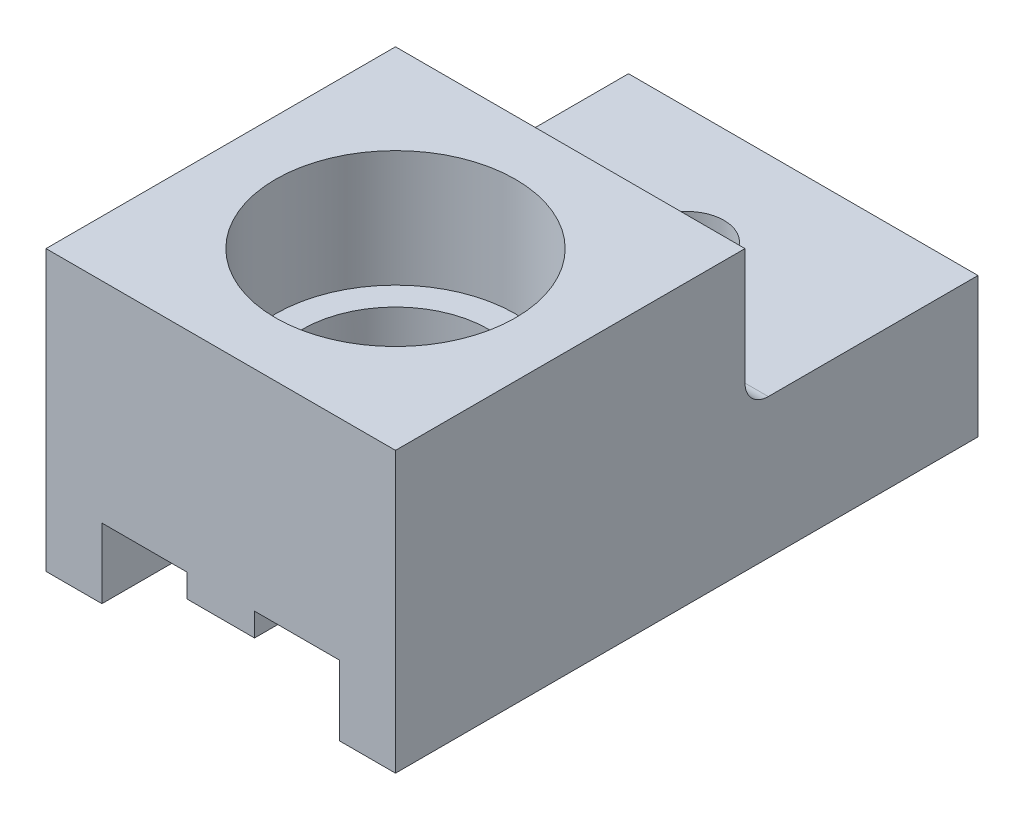
ISO-10303-21;
HEADER;
FILE_DESCRIPTION(('STEP AP214'),'2;1');
FILE_NAME('part.step','',(''),(''),'','','');
FILE_SCHEMA(('AUTOMOTIVE_DESIGN { 1 0 10303 214 1 1 1 1 }'));
ENDSEC;
DATA;
#1=APPLICATION_CONTEXT('core data for automotive mechanical design processes');
#2=APPLICATION_PROTOCOL_DEFINITION('international standard','automotive_design',2000,#1);
#3=PRODUCT_CONTEXT('',#1,'mechanical');
#4=PRODUCT('Part','Part','',(#3));
#5=PRODUCT_RELATED_PRODUCT_CATEGORY('part','',(#4));
#6=PRODUCT_DEFINITION_FORMATION('','',#4);
#7=PRODUCT_DEFINITION_CONTEXT('part definition',#1,'design');
#8=PRODUCT_DEFINITION('design','',#6,#7);
#9=PRODUCT_DEFINITION_SHAPE('','',#8);
#10=(LENGTH_UNIT() NAMED_UNIT(*) SI_UNIT(.MILLI.,.METRE.));
#11=(NAMED_UNIT(*) PLANE_ANGLE_UNIT() SI_UNIT($,.RADIAN.));
#12=(NAMED_UNIT(*) SI_UNIT($,.STERADIAN.) SOLID_ANGLE_UNIT());
#13=UNCERTAINTY_MEASURE_WITH_UNIT(LENGTH_MEASURE(1.E-05),#10,'distance_accuracy_value','');
#14=(GEOMETRIC_REPRESENTATION_CONTEXT(3) GLOBAL_UNCERTAINTY_ASSIGNED_CONTEXT((#13)) GLOBAL_UNIT_ASSIGNED_CONTEXT((#10,
#11,#12)) REPRESENTATION_CONTEXT('',''));
#15=CARTESIAN_POINT('',(0.,0.,0.));
#16=DIRECTION('',(0.,0.,1.));
#17=DIRECTION('',(1.,0.,0.));
#18=AXIS2_PLACEMENT_3D('',#15,#16,#17);
#19=CARTESIAN_POINT('',(-1.45,0.,25.));
#20=DIRECTION('',(1.,0.,0.));
#21=DIRECTION('',(0.,0.,-1.));
#22=AXIS2_PLACEMENT_3D('',#19,#20,#21);
#23=PLANE('',#22);
#24=DIRECTION('',(0.,0.,-1.));
#25=VECTOR('',#24,1.);
#26=CARTESIAN_POINT('',(-1.45,-1.,25.));
#27=LINE('',#26,#25);
#28=CARTESIAN_POINT('',(-1.45,-1.,4.32361253707657));
#29=VERTEX_POINT('',#28);
#30=CARTESIAN_POINT('',(-1.45,-1.,0.));
#31=VERTEX_POINT('',#30);
#32=EDGE_CURVE('E236',#29,#31,#27,.T.);
#33=ORIENTED_EDGE('',*,*,#32,.F.);
#34=DIRECTION('',(0.,1.,0.));
#35=VECTOR('',#34,1.);
#36=CARTESIAN_POINT('',(-1.45,-3.,4.32361253707657));
#37=LINE('',#36,#35);
#38=CARTESIAN_POINT('',(-1.45,0.,4.32361253707657));
#39=VERTEX_POINT('',#38);
#40=EDGE_CURVE('E276',#29,#39,#37,.T.);
#41=ORIENTED_EDGE('',*,*,#40,.T.);
#42=DIRECTION('',(0.,0.,-1.));
#43=VECTOR('',#42,1.);
#44=CARTESIAN_POINT('',(-1.45,0.,25.));
#45=LINE('',#44,#43);
#46=CARTESIAN_POINT('',(-1.45,0.,0.));
#47=VERTEX_POINT('',#46);
#48=EDGE_CURVE('E241',#39,#47,#45,.T.);
#49=ORIENTED_EDGE('',*,*,#48,.T.);
#50=DIRECTION('',(0.,-1.,0.));
#51=VECTOR('',#50,1.);
#52=CARTESIAN_POINT('',(-1.45,0.,0.));
#53=LINE('',#52,#51);
#54=EDGE_CURVE('E342',#47,#31,#53,.T.);
#55=ORIENTED_EDGE('',*,*,#54,.T.);
#56=EDGE_LOOP('',(#33,#41,#49,#55));
#57=FACE_BOUND('',#56,.T.);
#58=ADVANCED_FACE('F33',(#57),#23,.F.);
#59=CARTESIAN_POINT('',(-1.45,-1.,25.));
#60=DIRECTION('',(0.,1.,0.));
#61=DIRECTION('',(-1.,0.,0.));
#62=AXIS2_PLACEMENT_3D('',#59,#60,#61);
#63=PLANE('',#62);
#64=CARTESIAN_POINT('',(-1.45,-1.,13.7720649147283));
#65=VERTEX_POINT('',#64);
#66=CARTESIAN_POINT('',(-1.45,-1.,5.67638746292343));
#67=VERTEX_POINT('',#66);
#68=EDGE_CURVE('E242',#65,#67,#27,.T.);
#69=ORIENTED_EDGE('',*,*,#68,.T.);
#70=CARTESIAN_POINT('',(0.,-1.,5.));
#71=DIRECTION('',(0.,1.,0.));
#72=DIRECTION('',(-1.,0.,0.));
#73=AXIS2_PLACEMENT_3D('',#70,#71,#72);
#74=CIRCLE('',#73,1.6);
#75=CARTESIAN_POINT('',(1.45,-1.,5.67638746292343));
#76=VERTEX_POINT('',#75);
#77=EDGE_CURVE('E272',#67,#76,#74,.T.);
#78=ORIENTED_EDGE('',*,*,#77,.T.);
#79=DIRECTION('',(0.,0.,-1.));
#80=VECTOR('',#79,1.);
#81=CARTESIAN_POINT('',(1.45,-1.,25.));
#82=LINE('',#81,#80);
#83=CARTESIAN_POINT('',(1.45,-1.,13.7720649147283));
#84=VERTEX_POINT('',#83);
#85=EDGE_CURVE('E237',#84,#76,#82,.T.);
#86=ORIENTED_EDGE('',*,*,#85,.F.);
#87=CARTESIAN_POINT('',(0.,-1.,17.5));
#88=DIRECTION('',(0.,1.,0.));
#89=DIRECTION('',(-1.,0.,0.));
#90=AXIS2_PLACEMENT_3D('',#87,#88,#89);
#91=CIRCLE('',#90,4.);
#92=EDGE_CURVE('E294',#84,#65,#91,.T.);
#93=ORIENTED_EDGE('',*,*,#92,.T.);
#94=EDGE_LOOP('',(#69,#78,#86,#93));
#95=FACE_BOUND('',#94,.T.);
#96=ADVANCED_FACE('F410',(#95),#63,.F.);
#97=CARTESIAN_POINT('',(1.45,-1.,25.));
#98=DIRECTION('',(-1.,0.,0.));
#99=DIRECTION('',(0.,0.,1.));
#100=AXIS2_PLACEMENT_3D('',#97,#98,#99);
#101=PLANE('',#100);
#102=ORIENTED_EDGE('',*,*,#85,.T.);
#103=DIRECTION('',(0.,1.,0.));
#104=VECTOR('',#103,1.);
#105=CARTESIAN_POINT('',(1.45,-3.,5.67638746292343));
#106=LINE('',#105,#104);
#107=CARTESIAN_POINT('',(1.45,0.,5.67638746292343));
#108=VERTEX_POINT('',#107);
#109=EDGE_CURVE('E266',#76,#108,#106,.T.);
#110=ORIENTED_EDGE('',*,*,#109,.T.);
#111=DIRECTION('',(0.,0.,-1.));
#112=VECTOR('',#111,1.);
#113=CARTESIAN_POINT('',(1.45,0.,25.));
#114=LINE('',#113,#112);
#115=CARTESIAN_POINT('',(1.45,0.,13.7720649147283));
#116=VERTEX_POINT('',#115);
#117=EDGE_CURVE('E232',#116,#108,#114,.T.);
#118=ORIENTED_EDGE('',*,*,#117,.F.);
#119=DIRECTION('',(0.,1.,0.));
#120=VECTOR('',#119,1.);
#121=CARTESIAN_POINT('',(1.45,-3.,13.7720649147283));
#122=LINE('',#121,#120);
#123=EDGE_CURVE('E288',#116,#84,#122,.F.);
#124=ORIENTED_EDGE('',*,*,#123,.T.);
#125=EDGE_LOOP('',(#102,#110,#118,#124));
#126=FACE_BOUND('',#125,.T.);
#127=ADVANCED_FACE('F418',(#126),#101,.F.);
#128=CARTESIAN_POINT('',(-1.45,0.,13.7720649147283));
#129=VERTEX_POINT('',#128);
#130=CARTESIAN_POINT('',(-1.45,0.,5.67638746292343));
#131=VERTEX_POINT('',#130);
#132=EDGE_CURVE('E247',#129,#131,#45,.T.);
#133=ORIENTED_EDGE('',*,*,#132,.T.);
#134=DIRECTION('',(0.,1.,0.));
#135=VECTOR('',#134,1.);
#136=CARTESIAN_POINT('',(-1.45,-3.,5.67638746292343));
#137=LINE('',#136,#135);
#138=EDGE_CURVE('E273',#131,#67,#137,.F.);
#139=ORIENTED_EDGE('',*,*,#138,.T.);
#140=ORIENTED_EDGE('',*,*,#68,.F.);
#141=DIRECTION('',(0.,1.,0.));
#142=VECTOR('',#141,1.);
#143=CARTESIAN_POINT('',(-1.45,-3.,13.7720649147283));
#144=LINE('',#143,#142);
#145=EDGE_CURVE('E301',#65,#129,#144,.T.);
#146=ORIENTED_EDGE('',*,*,#145,.T.);
#147=EDGE_LOOP('',(#133,#139,#140,#146));
#148=FACE_BOUND('',#147,.T.);
#149=ADVANCED_FACE('F413',(#148),#23,.F.);
#150=CARTESIAN_POINT('',(-1.45,-1.,25.));
#151=VERTEX_POINT('',#150);
#152=CARTESIAN_POINT('',(-1.45,-1.,21.2279350852717));
#153=VERTEX_POINT('',#152);
#154=EDGE_CURVE('E238',#151,#153,#27,.T.);
#155=ORIENTED_EDGE('',*,*,#154,.T.);
#156=CARTESIAN_POINT('',(1.45,-1.,21.2279350852717));
#157=VERTEX_POINT('',#156);
#158=EDGE_CURVE('E297',#153,#157,#91,.T.);
#159=ORIENTED_EDGE('',*,*,#158,.T.);
#160=CARTESIAN_POINT('',(1.45,-1.,25.));
#161=VERTEX_POINT('',#160);
#162=EDGE_CURVE('E233',#161,#157,#82,.T.);
#163=ORIENTED_EDGE('',*,*,#162,.F.);
#164=DIRECTION('',(1.,0.,0.));
#165=VECTOR('',#164,1.);
#166=CARTESIAN_POINT('',(-1.45,-1.,25.));
#167=LINE('',#166,#165);
#168=EDGE_CURVE('E320',#151,#161,#167,.T.);
#169=ORIENTED_EDGE('',*,*,#168,.F.);
#170=EDGE_LOOP('',(#155,#159,#163,#169));
#171=FACE_BOUND('',#170,.T.);
#172=ADVANCED_FACE('F421',(#171),#63,.F.);
#173=ORIENTED_EDGE('',*,*,#162,.T.);
#174=DIRECTION('',(0.,1.,0.));
#175=VECTOR('',#174,1.);
#176=CARTESIAN_POINT('',(1.45,-3.,21.2279350852717));
#177=LINE('',#176,#175);
#178=CARTESIAN_POINT('',(1.45,0.,21.2279350852717));
#179=VERTEX_POINT('',#178);
#180=EDGE_CURVE('E291',#157,#179,#177,.T.);
#181=ORIENTED_EDGE('',*,*,#180,.T.);
#182=CARTESIAN_POINT('',(1.45,0.,25.));
#183=VERTEX_POINT('',#182);
#184=EDGE_CURVE('E228',#183,#179,#114,.T.);
#185=ORIENTED_EDGE('',*,*,#184,.F.);
#186=DIRECTION('',(0.,1.,0.));
#187=VECTOR('',#186,1.);
#188=CARTESIAN_POINT('',(1.45,-1.,25.));
#189=LINE('',#188,#187);
#190=EDGE_CURVE('E322',#161,#183,#189,.T.);
#191=ORIENTED_EDGE('',*,*,#190,.F.);
#192=EDGE_LOOP('',(#173,#181,#185,#191));
#193=FACE_BOUND('',#192,.T.);
#194=ADVANCED_FACE('F434',(#193),#101,.F.);
#195=CARTESIAN_POINT('',(-5.1,0.,25.));
#196=DIRECTION('',(0.,1.,0.));
#197=DIRECTION('',(0.,0.,1.));
#198=AXIS2_PLACEMENT_3D('',#195,#196,#197);
#199=PLANE('',#198);
#200=ORIENTED_EDGE('',*,*,#48,.F.);
#201=CARTESIAN_POINT('',(0.,0.,5.));
#202=DIRECTION('',(0.,1.,0.));
#203=DIRECTION('',(0.,0.,1.));
#204=AXIS2_PLACEMENT_3D('',#201,#202,#203);
#205=CIRCLE('',#204,1.6);
#206=EDGE_CURVE('E279',#39,#131,#205,.T.);
#207=ORIENTED_EDGE('',*,*,#206,.T.);
#208=ORIENTED_EDGE('',*,*,#132,.F.);
#209=CARTESIAN_POINT('',(0.,0.,17.5));
#210=DIRECTION('',(0.,1.,0.));
#211=DIRECTION('',(0.,0.,1.));
#212=AXIS2_PLACEMENT_3D('',#209,#210,#211);
#213=CIRCLE('',#212,4.);
#214=CARTESIAN_POINT('',(-1.45,0.,21.2279350852717));
#215=VERTEX_POINT('',#214);
#216=EDGE_CURVE('E304',#129,#215,#213,.T.);
#217=ORIENTED_EDGE('',*,*,#216,.T.);
#218=CARTESIAN_POINT('',(-1.45,0.,25.));
#219=VERTEX_POINT('',#218);
#220=EDGE_CURVE('E243',#219,#215,#45,.T.);
#221=ORIENTED_EDGE('',*,*,#220,.F.);
#222=DIRECTION('',(1.,0.,0.));
#223=VECTOR('',#222,1.);
#224=CARTESIAN_POINT('',(-5.1,0.,25.));
#225=LINE('',#224,#223);
#226=CARTESIAN_POINT('',(-5.1,0.,25.));
#227=VERTEX_POINT('',#226);
#228=EDGE_CURVE('E314',#227,#219,#225,.T.);
#229=ORIENTED_EDGE('',*,*,#228,.F.);
#230=DIRECTION('',(0.,0.,-1.));
#231=VECTOR('',#230,1.);
#232=CARTESIAN_POINT('',(-5.1,0.,25.));
#233=LINE('',#232,#231);
#234=CARTESIAN_POINT('',(-5.1,0.,0.));
#235=VERTEX_POINT('',#234);
#236=EDGE_CURVE('E339',#227,#235,#233,.T.);
#237=ORIENTED_EDGE('',*,*,#236,.T.);
#238=DIRECTION('',(1.,0.,0.));
#239=VECTOR('',#238,1.);
#240=CARTESIAN_POINT('',(-5.1,0.,0.));
#241=LINE('',#240,#239);
#242=EDGE_CURVE('E311',#235,#47,#241,.T.);
#243=ORIENTED_EDGE('',*,*,#242,.T.);
#244=EDGE_LOOP('',(#200,#207,#208,#217,#221,#229,#237,#243));
#245=FACE_BOUND('',#244,.T.);
#246=ADVANCED_FACE('F390',(#245),#199,.F.);
#247=ORIENTED_EDGE('',*,*,#220,.T.);
#248=DIRECTION('',(0.,1.,0.));
#249=VECTOR('',#248,1.);
#250=CARTESIAN_POINT('',(-1.45,-3.,21.2279350852717));
#251=LINE('',#250,#249);
#252=EDGE_CURVE('E298',#215,#153,#251,.F.);
#253=ORIENTED_EDGE('',*,*,#252,.T.);
#254=ORIENTED_EDGE('',*,*,#154,.F.);
#255=DIRECTION('',(0.,-1.,0.));
#256=VECTOR('',#255,1.);
#257=CARTESIAN_POINT('',(-1.45,0.,25.));
#258=LINE('',#257,#256);
#259=EDGE_CURVE('E317',#219,#151,#258,.T.);
#260=ORIENTED_EDGE('',*,*,#259,.F.);
#261=EDGE_LOOP('',(#247,#253,#254,#260));
#262=FACE_BOUND('',#261,.T.);
#263=ADVANCED_FACE('F414',(#262),#23,.F.);
#264=CARTESIAN_POINT('',(1.45,-1.,4.32361253707657));
#265=VERTEX_POINT('',#264);
#266=CARTESIAN_POINT('',(1.45,-1.,0.));
#267=VERTEX_POINT('',#266);
#268=EDGE_CURVE('E231',#265,#267,#82,.T.);
#269=ORIENTED_EDGE('',*,*,#268,.F.);
#270=EDGE_CURVE('E269',#265,#29,#74,.T.);
#271=ORIENTED_EDGE('',*,*,#270,.T.);
#272=ORIENTED_EDGE('',*,*,#32,.T.);
#273=DIRECTION('',(1.,0.,0.));
#274=VECTOR('',#273,1.);
#275=CARTESIAN_POINT('',(-1.45,-1.,0.));
#276=LINE('',#275,#274);
#277=EDGE_CURVE('E345',#31,#267,#276,.T.);
#278=ORIENTED_EDGE('',*,*,#277,.T.);
#279=EDGE_LOOP('',(#269,#271,#272,#278));
#280=FACE_BOUND('',#279,.T.);
#281=ADVANCED_FACE('F422',(#280),#63,.F.);
#282=CARTESIAN_POINT('',(1.45,0.,4.32361253707657));
#283=VERTEX_POINT('',#282);
#284=CARTESIAN_POINT('',(1.45,0.,0.));
#285=VERTEX_POINT('',#284);
#286=EDGE_CURVE('E227',#283,#285,#114,.T.);
#287=ORIENTED_EDGE('',*,*,#286,.F.);
#288=DIRECTION('',(0.,1.,0.));
#289=VECTOR('',#288,1.);
#290=CARTESIAN_POINT('',(1.45,-3.,4.32361253707657));
#291=LINE('',#290,#289);
#292=EDGE_CURVE('E263',#283,#265,#291,.F.);
#293=ORIENTED_EDGE('',*,*,#292,.T.);
#294=ORIENTED_EDGE('',*,*,#268,.T.);
#295=DIRECTION('',(0.,1.,0.));
#296=VECTOR('',#295,1.);
#297=CARTESIAN_POINT('',(1.45,-1.,0.));
#298=LINE('',#297,#296);
#299=EDGE_CURVE('E348',#267,#285,#298,.T.);
#300=ORIENTED_EDGE('',*,*,#299,.T.);
#301=EDGE_LOOP('',(#287,#293,#294,#300));
#302=FACE_BOUND('',#301,.T.);
#303=ADVANCED_FACE('F432',(#302),#101,.F.);
#304=CARTESIAN_POINT('',(1.45,0.,25.));
#305=DIRECTION('',(0.,1.,0.));
#306=DIRECTION('',(0.,0.,1.));
#307=AXIS2_PLACEMENT_3D('',#304,#305,#306);
#308=PLANE('',#307);
#309=ORIENTED_EDGE('',*,*,#117,.T.);
#310=CARTESIAN_POINT('',(0.,0.,5.));
#311=DIRECTION('',(0.,1.,0.));
#312=DIRECTION('',(0.,0.,1.));
#313=AXIS2_PLACEMENT_3D('',#310,#311,#312);
#314=CIRCLE('',#313,1.6);
#315=EDGE_CURVE('E250',#108,#283,#314,.T.);
#316=ORIENTED_EDGE('',*,*,#315,.T.);
#317=ORIENTED_EDGE('',*,*,#286,.T.);
#318=DIRECTION('',(1.,0.,0.));
#319=VECTOR('',#318,1.);
#320=CARTESIAN_POINT('',(1.45,0.,0.));
#321=LINE('',#320,#319);
#322=CARTESIAN_POINT('',(5.1,0.,0.));
#323=VERTEX_POINT('',#322);
#324=EDGE_CURVE('E351',#285,#323,#321,.T.);
#325=ORIENTED_EDGE('',*,*,#324,.T.);
#326=DIRECTION('',(0.,0.,-1.));
#327=VECTOR('',#326,1.);
#328=CARTESIAN_POINT('',(5.1,0.,25.));
#329=LINE('',#328,#327);
#330=CARTESIAN_POINT('',(5.1,0.,25.));
#331=VERTEX_POINT('',#330);
#332=EDGE_CURVE('E224',#331,#323,#329,.T.);
#333=ORIENTED_EDGE('',*,*,#332,.F.);
#334=DIRECTION('',(1.,0.,0.));
#335=VECTOR('',#334,1.);
#336=CARTESIAN_POINT('',(1.45,0.,25.));
#337=LINE('',#336,#335);
#338=EDGE_CURVE('E324',#183,#331,#337,.T.);
#339=ORIENTED_EDGE('',*,*,#338,.F.);
#340=ORIENTED_EDGE('',*,*,#184,.T.);
#341=CARTESIAN_POINT('',(0.,0.,17.5));
#342=DIRECTION('',(0.,1.,0.));
#343=DIRECTION('',(0.,0.,1.));
#344=AXIS2_PLACEMENT_3D('',#341,#342,#343);
#345=CIRCLE('',#344,4.);
#346=EDGE_CURVE('E285',#179,#116,#345,.T.);
#347=ORIENTED_EDGE('',*,*,#346,.T.);
#348=EDGE_LOOP('',(#309,#316,#317,#325,#333,#339,#340,#347));
#349=FACE_BOUND('',#348,.T.);
#350=ADVANCED_FACE('F446',(#349),#308,.F.);
#351=CARTESIAN_POINT('',(5.1,0.,25.));
#352=DIRECTION('',(1.,0.,0.));
#353=DIRECTION('',(0.,0.,-1.));
#354=AXIS2_PLACEMENT_3D('',#351,#352,#353);
#355=PLANE('',#354);
#356=DIRECTION('',(0.,-1.,0.));
#357=VECTOR('',#356,1.);
#358=CARTESIAN_POINT('',(5.1,0.,0.));
#359=LINE('',#358,#357);
#360=CARTESIAN_POINT('',(5.1,-3.,0.));
#361=VERTEX_POINT('',#360);
#362=EDGE_CURVE('E353',#323,#361,#359,.T.);
#363=ORIENTED_EDGE('',*,*,#362,.T.);
#364=DIRECTION('',(0.,0.,-1.));
#365=VECTOR('',#364,1.);
#366=CARTESIAN_POINT('',(5.1,-3.,25.));
#367=LINE('',#366,#365);
#368=CARTESIAN_POINT('',(5.1,-3.,25.));
#369=VERTEX_POINT('',#368);
#370=EDGE_CURVE('E216',#369,#361,#367,.T.);
#371=ORIENTED_EDGE('',*,*,#370,.F.);
#372=DIRECTION('',(0.,-1.,0.));
#373=VECTOR('',#372,1.);
#374=CARTESIAN_POINT('',(5.1,0.,25.));
#375=LINE('',#374,#373);
#376=EDGE_CURVE('E326',#331,#369,#375,.T.);
#377=ORIENTED_EDGE('',*,*,#376,.F.);
#378=ORIENTED_EDGE('',*,*,#332,.T.);
#379=EDGE_LOOP('',(#363,#371,#377,#378));
#380=FACE_BOUND('',#379,.T.);
#381=ADVANCED_FACE('F451',(#380),#355,.F.);
#382=CARTESIAN_POINT('',(5.1,-3.,25.));
#383=DIRECTION('',(0.,1.,0.));
#384=DIRECTION('',(-1.,0.,0.));
#385=AXIS2_PLACEMENT_3D('',#382,#383,#384);
#386=PLANE('',#385);
#387=DIRECTION('',(1.,0.,0.));
#388=VECTOR('',#387,1.);
#389=CARTESIAN_POINT('',(5.1,-3.,0.));
#390=LINE('',#389,#388);
#391=CARTESIAN_POINT('',(7.5,-3.,0.));
#392=VERTEX_POINT('',#391);
#393=EDGE_CURVE('E355',#361,#392,#390,.T.);
#394=ORIENTED_EDGE('',*,*,#393,.T.);
#395=DIRECTION('',(0.,0.,-1.));
#396=VECTOR('',#395,1.);
#397=CARTESIAN_POINT('',(7.5,-3.,25.));
#398=LINE('',#397,#396);
#399=CARTESIAN_POINT('',(7.5,-3.,25.));
#400=VERTEX_POINT('',#399);
#401=EDGE_CURVE('E212',#400,#392,#398,.T.);
#402=ORIENTED_EDGE('',*,*,#401,.F.);
#403=DIRECTION('',(1.,0.,0.));
#404=VECTOR('',#403,1.);
#405=CARTESIAN_POINT('',(5.1,-3.,25.));
#406=LINE('',#405,#404);
#407=EDGE_CURVE('E328',#369,#400,#406,.T.);
#408=ORIENTED_EDGE('',*,*,#407,.F.);
#409=ORIENTED_EDGE('',*,*,#370,.T.);
#410=EDGE_LOOP('',(#394,#402,#408,#409));
#411=FACE_BOUND('',#410,.T.);
#412=ADVANCED_FACE('F452',(#411),#386,.F.);
#413=CARTESIAN_POINT('',(7.5,-3.,25.));
#414=DIRECTION('',(-1.,0.,0.));
#415=DIRECTION('',(0.,0.,1.));
#416=AXIS2_PLACEMENT_3D('',#413,#414,#415);
#417=PLANE('',#416);
#418=DIRECTION('',(0.,0.,1.));
#419=VECTOR('',#418,1.);
#420=CARTESIAN_POINT('',(7.5,3.,0.));
#421=LINE('',#420,#419);
#422=CARTESIAN_POINT('',(7.5,3.,0.));
#423=VERTEX_POINT('',#422);
#424=CARTESIAN_POINT('',(7.5,3.,9.));
#425=VERTEX_POINT('',#424);
#426=EDGE_CURVE('E199',#423,#425,#421,.T.);
#427=ORIENTED_EDGE('',*,*,#426,.T.);
#428=CARTESIAN_POINT('',(7.5,4.,9.));
#429=DIRECTION('',(-1.,0.,0.));
#430=DIRECTION('',(0.,0.,1.));
#431=AXIS2_PLACEMENT_3D('',#428,#429,#430);
#432=CIRCLE('',#431,1.);
#433=CARTESIAN_POINT('',(7.5,4.,10.));
#434=VERTEX_POINT('',#433);
#435=EDGE_CURVE('E11',#425,#434,#432,.T.);
#436=ORIENTED_EDGE('',*,*,#435,.T.);
#437=DIRECTION('',(0.,1.,0.));
#438=VECTOR('',#437,1.);
#439=CARTESIAN_POINT('',(7.5,9.,10.));
#440=LINE('',#439,#438);
#441=CARTESIAN_POINT('',(7.5,9.,10.));
#442=VERTEX_POINT('',#441);
#443=EDGE_CURVE('E187',#434,#442,#440,.T.);
#444=ORIENTED_EDGE('',*,*,#443,.T.);
#445=DIRECTION('',(0.,0.,-1.));
#446=VECTOR('',#445,1.);
#447=CARTESIAN_POINT('',(7.5,9.,25.));
#448=LINE('',#447,#446);
#449=CARTESIAN_POINT('',(7.5,9.,25.));
#450=VERTEX_POINT('',#449);
#451=EDGE_CURVE('E192',#450,#442,#448,.T.);
#452=ORIENTED_EDGE('',*,*,#451,.F.);
#453=DIRECTION('',(0.,1.,0.));
#454=VECTOR('',#453,1.);
#455=CARTESIAN_POINT('',(7.5,-3.,25.));
#456=LINE('',#455,#454);
#457=EDGE_CURVE('E330',#400,#450,#456,.T.);
#458=ORIENTED_EDGE('',*,*,#457,.F.);
#459=ORIENTED_EDGE('',*,*,#401,.T.);
#460=DIRECTION('',(0.,1.,0.));
#461=VECTOR('',#460,1.);
#462=CARTESIAN_POINT('',(7.5,-3.,0.));
#463=LINE('',#462,#461);
#464=EDGE_CURVE('E357',#392,#423,#463,.T.);
#465=ORIENTED_EDGE('',*,*,#464,.T.);
#466=EDGE_LOOP('',(#427,#436,#444,#452,#458,#459,#465));
#467=FACE_BOUND('',#466,.T.);
#468=ADVANCED_FACE('F189',(#467),#417,.F.);
#469=CARTESIAN_POINT('',(7.5,9.,25.));
#470=DIRECTION('',(0.,-1.,0.));
#471=DIRECTION('',(0.,0.,-1.));
#472=AXIS2_PLACEMENT_3D('',#469,#470,#471);
#473=PLANE('',#472);
#474=CARTESIAN_POINT('',(0.,9.,17.5));
#475=DIRECTION('',(0.,1.,0.));
#476=DIRECTION('',(-1.,0.,0.));
#477=AXIS2_PLACEMENT_3D('',#474,#475,#476);
#478=CIRCLE('',#477,5.15);
#479=CARTESIAN_POINT('',(-5.15,9.,17.5));
#480=VERTEX_POINT('',#479);
#481=EDGE_CURVE('E307',#480,#480,#478,.T.);
#482=ORIENTED_EDGE('',*,*,#481,.F.);
#483=EDGE_LOOP('',(#482));
#484=FACE_BOUND('',#483,.T.);
#485=ORIENTED_EDGE('',*,*,#451,.T.);
#486=DIRECTION('',(-1.,0.,0.));
#487=VECTOR('',#486,1.);
#488=CARTESIAN_POINT('',(7.5,9.,10.));
#489=LINE('',#488,#487);
#490=CARTESIAN_POINT('',(-7.5,9.,10.));
#491=VERTEX_POINT('',#490);
#492=EDGE_CURVE('E202',#442,#491,#489,.T.);
#493=ORIENTED_EDGE('',*,*,#492,.T.);
#494=DIRECTION('',(0.,0.,-1.));
#495=VECTOR('',#494,1.);
#496=CARTESIAN_POINT('',(-7.5,9.,25.));
#497=LINE('',#496,#495);
#498=CARTESIAN_POINT('',(-7.5,9.,25.));
#499=VERTEX_POINT('',#498);
#500=EDGE_CURVE('E213',#499,#491,#497,.T.);
#501=ORIENTED_EDGE('',*,*,#500,.F.);
#502=DIRECTION('',(-1.,0.,0.));
#503=VECTOR('',#502,1.);
#504=CARTESIAN_POINT('',(7.5,9.,25.));
#505=LINE('',#504,#503);
#506=EDGE_CURVE('E211',#450,#499,#505,.T.);
#507=ORIENTED_EDGE('',*,*,#506,.F.);
#508=EDGE_LOOP('',(#485,#493,#501,#507));
#509=FACE_BOUND('',#508,.T.);
#510=ADVANCED_FACE('F210',(#484,#509),#473,.F.);
#511=CARTESIAN_POINT('',(-7.5,-3.,25.));
#512=DIRECTION('',(1.,0.,0.));
#513=DIRECTION('',(0.,0.,-1.));
#514=AXIS2_PLACEMENT_3D('',#511,#512,#513);
#515=PLANE('',#514);
#516=ORIENTED_EDGE('',*,*,#500,.T.);
#517=DIRECTION('',(0.,1.,0.));
#518=VECTOR('',#517,1.);
#519=CARTESIAN_POINT('',(-7.5,9.,10.));
#520=LINE('',#519,#518);
#521=CARTESIAN_POINT('',(-7.5,4.,10.));
#522=VERTEX_POINT('',#521);
#523=EDGE_CURVE('E204',#522,#491,#520,.T.);
#524=ORIENTED_EDGE('',*,*,#523,.F.);
#525=CARTESIAN_POINT('',(-7.5,4.,9.));
#526=DIRECTION('',(1.,0.,0.));
#527=DIRECTION('',(0.,0.,-1.));
#528=AXIS2_PLACEMENT_3D('',#525,#526,#527);
#529=CIRCLE('',#528,1.);
#530=CARTESIAN_POINT('',(-7.5,3.,9.));
#531=VERTEX_POINT('',#530);
#532=EDGE_CURVE('E41',#522,#531,#529,.T.);
#533=ORIENTED_EDGE('',*,*,#532,.T.);
#534=DIRECTION('',(0.,0.,1.));
#535=VECTOR('',#534,1.);
#536=CARTESIAN_POINT('',(-7.5,3.,0.));
#537=LINE('',#536,#535);
#538=CARTESIAN_POINT('',(-7.5,3.,0.));
#539=VERTEX_POINT('',#538);
#540=EDGE_CURVE('E255',#539,#531,#537,.T.);
#541=ORIENTED_EDGE('',*,*,#540,.F.);
#542=DIRECTION('',(0.,-1.,0.));
#543=VECTOR('',#542,1.);
#544=CARTESIAN_POINT('',(-7.5,-3.,0.));
#545=LINE('',#544,#543);
#546=CARTESIAN_POINT('',(-7.5,-3.,0.));
#547=VERTEX_POINT('',#546);
#548=EDGE_CURVE('E360',#539,#547,#545,.T.);
#549=ORIENTED_EDGE('',*,*,#548,.T.);
#550=DIRECTION('',(0.,0.,-1.));
#551=VECTOR('',#550,1.);
#552=CARTESIAN_POINT('',(-7.5,-3.,25.));
#553=LINE('',#552,#551);
#554=CARTESIAN_POINT('',(-7.5,-3.,25.));
#555=VERTEX_POINT('',#554);
#556=EDGE_CURVE('E218',#555,#547,#553,.T.);
#557=ORIENTED_EDGE('',*,*,#556,.F.);
#558=DIRECTION('',(0.,-1.,0.));
#559=VECTOR('',#558,1.);
#560=CARTESIAN_POINT('',(-7.5,-3.,25.));
#561=LINE('',#560,#559);
#562=EDGE_CURVE('E333',#499,#555,#561,.T.);
#563=ORIENTED_EDGE('',*,*,#562,.F.);
#564=EDGE_LOOP('',(#516,#524,#533,#541,#549,#557,#563));
#565=FACE_BOUND('',#564,.T.);
#566=ADVANCED_FACE('F253',(#565),#515,.F.);
#567=CARTESIAN_POINT('',(-5.1,-3.,25.));
#568=DIRECTION('',(0.,1.,0.));
#569=DIRECTION('',(-1.,0.,0.));
#570=AXIS2_PLACEMENT_3D('',#567,#568,#569);
#571=PLANE('',#570);
#572=DIRECTION('',(1.,0.,0.));
#573=VECTOR('',#572,1.);
#574=CARTESIAN_POINT('',(-5.1,-3.,0.));
#575=LINE('',#574,#573);
#576=CARTESIAN_POINT('',(-5.1,-3.,0.));
#577=VERTEX_POINT('',#576);
#578=EDGE_CURVE('E362',#547,#577,#575,.T.);
#579=ORIENTED_EDGE('',*,*,#578,.T.);
#580=DIRECTION('',(0.,0.,-1.));
#581=VECTOR('',#580,1.);
#582=CARTESIAN_POINT('',(-5.1,-3.,25.));
#583=LINE('',#582,#581);
#584=CARTESIAN_POINT('',(-5.1,-3.,25.));
#585=VERTEX_POINT('',#584);
#586=EDGE_CURVE('E367',#585,#577,#583,.T.);
#587=ORIENTED_EDGE('',*,*,#586,.F.);
#588=DIRECTION('',(1.,0.,0.));
#589=VECTOR('',#588,1.);
#590=CARTESIAN_POINT('',(-5.1,-3.,25.));
#591=LINE('',#590,#589);
#592=EDGE_CURVE('E335',#555,#585,#591,.T.);
#593=ORIENTED_EDGE('',*,*,#592,.F.);
#594=ORIENTED_EDGE('',*,*,#556,.T.);
#595=EDGE_LOOP('',(#579,#587,#593,#594));
#596=FACE_BOUND('',#595,.T.);
#597=ADVANCED_FACE('F374',(#596),#571,.F.);
#598=CARTESIAN_POINT('',(-5.1,0.,25.));
#599=DIRECTION('',(-1.,0.,0.));
#600=DIRECTION('',(0.,0.,1.));
#601=AXIS2_PLACEMENT_3D('',#598,#599,#600);
#602=PLANE('',#601);
#603=DIRECTION('',(0.,1.,0.));
#604=VECTOR('',#603,1.);
#605=CARTESIAN_POINT('',(-5.1,0.,0.));
#606=LINE('',#605,#604);
#607=EDGE_CURVE('E318',#577,#235,#606,.T.);
#608=ORIENTED_EDGE('',*,*,#607,.T.);
#609=ORIENTED_EDGE('',*,*,#236,.F.);
#610=DIRECTION('',(0.,1.,0.));
#611=VECTOR('',#610,1.);
#612=CARTESIAN_POINT('',(-5.1,0.,25.));
#613=LINE('',#612,#611);
#614=EDGE_CURVE('E337',#585,#227,#613,.T.);
#615=ORIENTED_EDGE('',*,*,#614,.F.);
#616=ORIENTED_EDGE('',*,*,#586,.T.);
#617=EDGE_LOOP('',(#608,#609,#615,#616));
#618=FACE_BOUND('',#617,.T.);
#619=ADVANCED_FACE('F385',(#618),#602,.F.);
#620=CARTESIAN_POINT('',(0.,0.,25.));
#621=DIRECTION('',(0.,0.,-1.));
#622=DIRECTION('',(-1.,0.,0.));
#623=AXIS2_PLACEMENT_3D('',#620,#621,#622);
#624=PLANE('',#623);
#625=ORIENTED_EDGE('',*,*,#228,.T.);
#626=ORIENTED_EDGE('',*,*,#259,.T.);
#627=ORIENTED_EDGE('',*,*,#168,.T.);
#628=ORIENTED_EDGE('',*,*,#190,.T.);
#629=ORIENTED_EDGE('',*,*,#338,.T.);
#630=ORIENTED_EDGE('',*,*,#376,.T.);
#631=ORIENTED_EDGE('',*,*,#407,.T.);
#632=ORIENTED_EDGE('',*,*,#457,.T.);
#633=ORIENTED_EDGE('',*,*,#506,.T.);
#634=ORIENTED_EDGE('',*,*,#562,.T.);
#635=ORIENTED_EDGE('',*,*,#592,.T.);
#636=ORIENTED_EDGE('',*,*,#614,.T.);
#637=EDGE_LOOP('',(#625,#626,#627,#628,#629,#630,#631,#632,#633,#634,#635,#636));
#638=FACE_BOUND('',#637,.T.);
#639=ADVANCED_FACE('F393',(#638),#624,.F.);
#640=CARTESIAN_POINT('',(0.,0.,0.));
#641=DIRECTION('',(0.,0.,-1.));
#642=DIRECTION('',(-1.,0.,0.));
#643=AXIS2_PLACEMENT_3D('',#640,#641,#642);
#644=PLANE('',#643);
#645=DIRECTION('',(-1.,0.,0.));
#646=VECTOR('',#645,1.);
#647=CARTESIAN_POINT('',(7.5,3.,0.));
#648=LINE('',#647,#646);
#649=EDGE_CURVE('E198',#423,#539,#648,.T.);
#650=ORIENTED_EDGE('',*,*,#649,.F.);
#651=ORIENTED_EDGE('',*,*,#464,.F.);
#652=ORIENTED_EDGE('',*,*,#393,.F.);
#653=ORIENTED_EDGE('',*,*,#362,.F.);
#654=ORIENTED_EDGE('',*,*,#324,.F.);
#655=ORIENTED_EDGE('',*,*,#299,.F.);
#656=ORIENTED_EDGE('',*,*,#277,.F.);
#657=ORIENTED_EDGE('',*,*,#54,.F.);
#658=ORIENTED_EDGE('',*,*,#242,.F.);
#659=ORIENTED_EDGE('',*,*,#607,.F.);
#660=ORIENTED_EDGE('',*,*,#578,.F.);
#661=ORIENTED_EDGE('',*,*,#548,.F.);
#662=EDGE_LOOP('',(#650,#651,#652,#653,#654,#655,#656,#657,#658,#659,#660,#661));
#663=FACE_BOUND('',#662,.T.);
#664=ADVANCED_FACE('F380',(#663),#644,.T.);
#665=CARTESIAN_POINT('',(0.,4.,17.5));
#666=DIRECTION('',(0.,1.,0.));
#667=DIRECTION('',(-1.,0.,0.));
#668=AXIS2_PLACEMENT_3D('',#665,#666,#667);
#669=CYLINDRICAL_SURFACE('',#668,5.15);
#670=CARTESIAN_POINT('',(0.,4.,17.5));
#671=DIRECTION('',(0.,1.,0.));
#672=DIRECTION('',(-1.,0.,0.));
#673=AXIS2_PLACEMENT_3D('',#670,#671,#672);
#674=CIRCLE('',#673,5.15);
#675=CARTESIAN_POINT('',(-5.15,4.,17.5));
#676=VERTEX_POINT('',#675);
#677=EDGE_CURVE('E308',#676,#676,#674,.T.);
#678=ORIENTED_EDGE('',*,*,#677,.F.);
#679=EDGE_LOOP('',(#678));
#680=FACE_BOUND('',#679,.T.);
#681=ORIENTED_EDGE('',*,*,#481,.T.);
#682=EDGE_LOOP('',(#681));
#683=FACE_BOUND('',#682,.T.);
#684=ADVANCED_FACE('F519',(#680,#683),#669,.F.);
#685=CARTESIAN_POINT('',(0.,4.,17.5));
#686=DIRECTION('',(0.,1.,0.));
#687=DIRECTION('',(-1.,0.,0.));
#688=AXIS2_PLACEMENT_3D('',#685,#686,#687);
#689=PLANE('',#688);
#690=CARTESIAN_POINT('',(0.,4.,17.5));
#691=DIRECTION('',(0.,1.,0.));
#692=DIRECTION('',(-1.,0.,0.));
#693=AXIS2_PLACEMENT_3D('',#690,#691,#692);
#694=CIRCLE('',#693,4.);
#695=CARTESIAN_POINT('',(-4.,4.,17.5));
#696=VERTEX_POINT('',#695);
#697=EDGE_CURVE('E282',#696,#696,#694,.T.);
#698=ORIENTED_EDGE('',*,*,#697,.F.);
#699=EDGE_LOOP('',(#698));
#700=FACE_BOUND('',#699,.T.);
#701=ORIENTED_EDGE('',*,*,#677,.T.);
#702=EDGE_LOOP('',(#701));
#703=FACE_BOUND('',#702,.T.);
#704=ADVANCED_FACE('F509',(#700,#703),#689,.T.);
#705=CARTESIAN_POINT('',(0.,-3.,17.5));
#706=DIRECTION('',(0.,1.,0.));
#707=DIRECTION('',(-1.,0.,0.));
#708=AXIS2_PLACEMENT_3D('',#705,#706,#707);
#709=CYLINDRICAL_SURFACE('',#708,4.);
#710=ORIENTED_EDGE('',*,*,#697,.T.);
#711=EDGE_LOOP('',(#710));
#712=FACE_BOUND('',#711,.T.);
#713=ORIENTED_EDGE('',*,*,#145,.F.);
#714=ORIENTED_EDGE('',*,*,#92,.F.);
#715=ORIENTED_EDGE('',*,*,#123,.F.);
#716=ORIENTED_EDGE('',*,*,#346,.F.);
#717=ORIENTED_EDGE('',*,*,#180,.F.);
#718=ORIENTED_EDGE('',*,*,#158,.F.);
#719=ORIENTED_EDGE('',*,*,#252,.F.);
#720=ORIENTED_EDGE('',*,*,#216,.F.);
#721=EDGE_LOOP('',(#713,#714,#715,#716,#717,#718,#719,#720));
#722=FACE_BOUND('',#721,.T.);
#723=ADVANCED_FACE('F503',(#712,#722),#709,.F.);
#724=CARTESIAN_POINT('',(0.,-3.,5.));
#725=DIRECTION('',(0.,1.,0.));
#726=DIRECTION('',(0.,0.,1.));
#727=AXIS2_PLACEMENT_3D('',#724,#725,#726);
#728=CYLINDRICAL_SURFACE('',#727,1.6);
#729=CARTESIAN_POINT('',(0.,3.,5.));
#730=DIRECTION('',(0.,-1.,0.));
#731=DIRECTION('',(0.,0.,-1.));
#732=AXIS2_PLACEMENT_3D('',#729,#730,#731);
#733=CIRCLE('',#732,1.6);
#734=CARTESIAN_POINT('',(0.,3.,3.4));
#735=VERTEX_POINT('',#734);
#736=EDGE_CURVE('E208',#735,#735,#733,.F.);
#737=ORIENTED_EDGE('',*,*,#736,.T.);
#738=EDGE_LOOP('',(#737));
#739=FACE_BOUND('',#738,.T.);
#740=ORIENTED_EDGE('',*,*,#40,.F.);
#741=ORIENTED_EDGE('',*,*,#270,.F.);
#742=ORIENTED_EDGE('',*,*,#292,.F.);
#743=ORIENTED_EDGE('',*,*,#315,.F.);
#744=ORIENTED_EDGE('',*,*,#109,.F.);
#745=ORIENTED_EDGE('',*,*,#77,.F.);
#746=ORIENTED_EDGE('',*,*,#138,.F.);
#747=ORIENTED_EDGE('',*,*,#206,.F.);
#748=EDGE_LOOP('',(#740,#741,#742,#743,#744,#745,#746,#747));
#749=FACE_BOUND('',#748,.T.);
#750=ADVANCED_FACE('F508',(#739,#749),#728,.F.);
#751=CARTESIAN_POINT('',(7.5,3.,0.));
#752=DIRECTION('',(0.,-1.,0.));
#753=DIRECTION('',(0.,0.,-1.));
#754=AXIS2_PLACEMENT_3D('',#751,#752,#753);
#755=PLANE('',#754);
#756=ORIENTED_EDGE('',*,*,#540,.T.);
#757=DIRECTION('',(-1.,0.,0.));
#758=VECTOR('',#757,1.);
#759=CARTESIAN_POINT('',(7.5,3.,9.));
#760=LINE('',#759,#758);
#761=EDGE_CURVE('E48',#531,#425,#760,.F.);
#762=ORIENTED_EDGE('',*,*,#761,.T.);
#763=ORIENTED_EDGE('',*,*,#426,.F.);
#764=ORIENTED_EDGE('',*,*,#649,.T.);
#765=EDGE_LOOP('',(#756,#762,#763,#764));
#766=FACE_BOUND('',#765,.T.);
#767=ORIENTED_EDGE('',*,*,#736,.F.);
#768=EDGE_LOOP('',(#767));
#769=FACE_BOUND('',#768,.T.);
#770=ADVANCED_FACE('F401',(#766,#769),#755,.F.);
#771=CARTESIAN_POINT('',(7.5,9.,10.));
#772=DIRECTION('',(0.,0.,1.));
#773=DIRECTION('',(1.,0.,0.));
#774=AXIS2_PLACEMENT_3D('',#771,#772,#773);
#775=PLANE('',#774);
#776=ORIENTED_EDGE('',*,*,#443,.F.);
#777=DIRECTION('',(-1.,0.,0.));
#778=VECTOR('',#777,1.);
#779=CARTESIAN_POINT('',(-7.5,4.,10.));
#780=LINE('',#779,#778);
#781=EDGE_CURVE('E246',#434,#522,#780,.T.);
#782=ORIENTED_EDGE('',*,*,#781,.T.);
#783=ORIENTED_EDGE('',*,*,#523,.T.);
#784=ORIENTED_EDGE('',*,*,#492,.F.);
#785=EDGE_LOOP('',(#776,#782,#783,#784));
#786=FACE_BOUND('',#785,.T.);
#787=ADVANCED_FACE('F203',(#786),#775,.F.);
#788=CARTESIAN_POINT('',(7.5,4.,9.));
#789=DIRECTION('',(1.,0.,0.));
#790=DIRECTION('',(0.,0.,-1.));
#791=AXIS2_PLACEMENT_3D('',#788,#789,#790);
#792=CYLINDRICAL_SURFACE('',#791,1.);
#793=ORIENTED_EDGE('',*,*,#435,.F.);
#794=ORIENTED_EDGE('',*,*,#761,.F.);
#795=ORIENTED_EDGE('',*,*,#532,.F.);
#796=ORIENTED_EDGE('',*,*,#781,.F.);
#797=EDGE_LOOP('',(#793,#794,#795,#796));
#798=FACE_BOUND('',#797,.T.);
#799=ADVANCED_FACE('F35',(#798),#792,.F.);
#800=CLOSED_SHELL('',(#58,#96,#127,#149,#172,#194,#246,#263,#281,#303,#350,#381,#412,#468,#510,
#566,#597,#619,#639,#664,#684,#704,#723,#750,#770,#787,#799));
#801=MANIFOLD_SOLID_BREP('B2',#800);
#802=ADVANCED_BREP_SHAPE_REPRESENTATION('',(#18,#801),#14);
#803=SHAPE_DEFINITION_REPRESENTATION(#9,#802);
ENDSEC;
END-ISO-10303-21;
